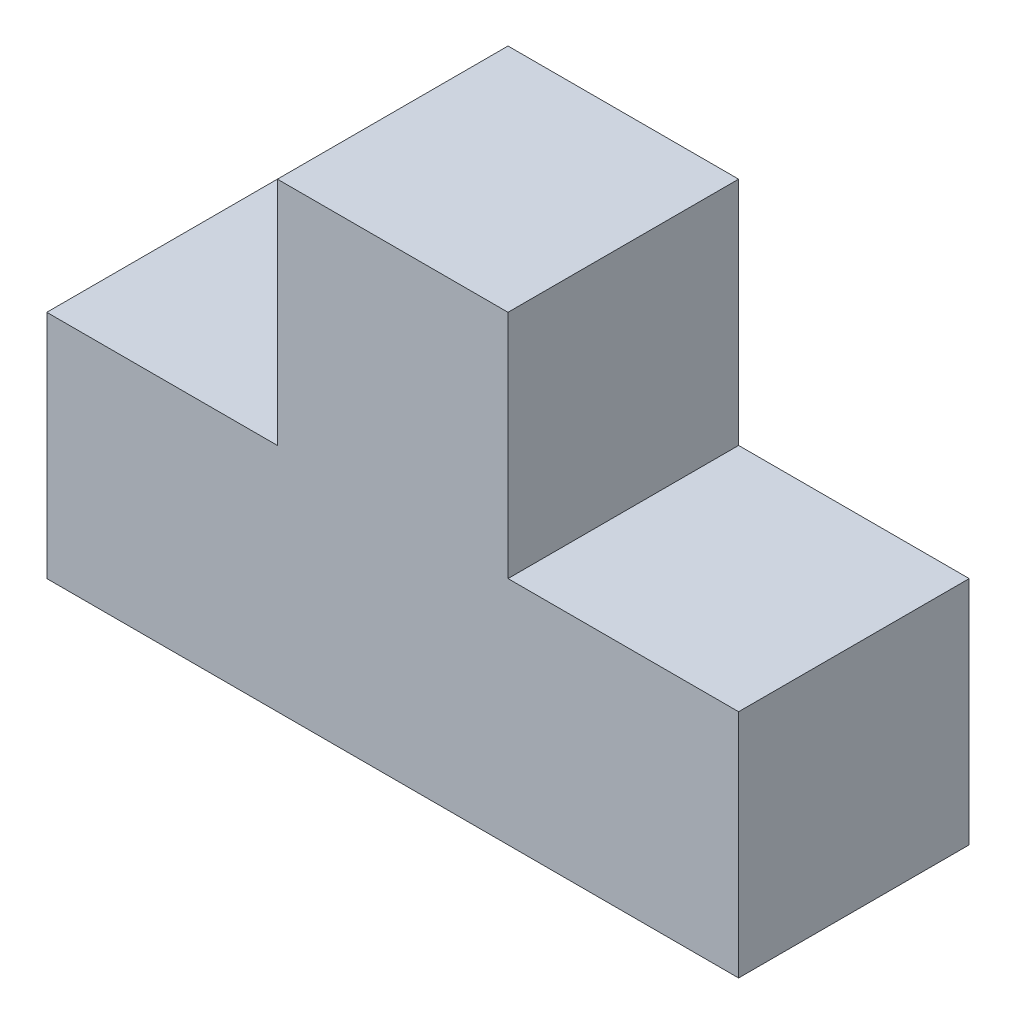
ISO-10303-21;
HEADER;
FILE_DESCRIPTION(('STEP AP214'),'2;1');
FILE_NAME('part.step','',(''),(''),'','','');
FILE_SCHEMA(('AUTOMOTIVE_DESIGN { 1 0 10303 214 1 1 1 1 }'));
ENDSEC;
DATA;
#1=APPLICATION_CONTEXT('core data for automotive mechanical design processes');
#2=APPLICATION_PROTOCOL_DEFINITION('international standard','automotive_design',2000,#1);
#3=PRODUCT_CONTEXT('',#1,'mechanical');
#4=PRODUCT('Part','Part','',(#3));
#5=PRODUCT_RELATED_PRODUCT_CATEGORY('part','',(#4));
#6=PRODUCT_DEFINITION_FORMATION('','',#4);
#7=PRODUCT_DEFINITION_CONTEXT('part definition',#1,'design');
#8=PRODUCT_DEFINITION('design','',#6,#7);
#9=PRODUCT_DEFINITION_SHAPE('','',#8);
#10=(LENGTH_UNIT() NAMED_UNIT(*) SI_UNIT(.MILLI.,.METRE.));
#11=(NAMED_UNIT(*) PLANE_ANGLE_UNIT() SI_UNIT($,.RADIAN.));
#12=(NAMED_UNIT(*) SI_UNIT($,.STERADIAN.) SOLID_ANGLE_UNIT());
#13=UNCERTAINTY_MEASURE_WITH_UNIT(LENGTH_MEASURE(1.E-05),#10,'distance_accuracy_value','');
#14=(GEOMETRIC_REPRESENTATION_CONTEXT(3) GLOBAL_UNCERTAINTY_ASSIGNED_CONTEXT((#13)) GLOBAL_UNIT_ASSIGNED_CONTEXT((#10,
#11,#12)) REPRESENTATION_CONTEXT('',''));
#15=CARTESIAN_POINT('',(0.,0.,0.));
#16=DIRECTION('',(0.,0.,1.));
#17=DIRECTION('',(1.,0.,0.));
#18=AXIS2_PLACEMENT_3D('',#15,#16,#17);
#19=CARTESIAN_POINT('',(0.,30.,30.));
#20=DIRECTION('',(1.,0.,0.));
#21=DIRECTION('',(0.,1.,0.));
#22=AXIS2_PLACEMENT_3D('',#19,#20,#21);
#23=PLANE('',#22);
#24=DIRECTION('',(0.,-1.,0.));
#25=VECTOR('',#24,1.);
#26=CARTESIAN_POINT('',(0.,30.,0.));
#27=LINE('',#26,#25);
#28=CARTESIAN_POINT('',(0.,30.,0.));
#29=VERTEX_POINT('',#28);
#30=CARTESIAN_POINT('',(0.,0.,0.));
#31=VERTEX_POINT('',#30);
#32=EDGE_CURVE('E129',#29,#31,#27,.T.);
#33=ORIENTED_EDGE('',*,*,#32,.T.);
#34=DIRECTION('',(0.,0.,-1.));
#35=VECTOR('',#34,1.);
#36=CARTESIAN_POINT('',(0.,0.,30.));
#37=LINE('',#36,#35);
#38=CARTESIAN_POINT('',(0.,0.,30.));
#39=VERTEX_POINT('',#38);
#40=EDGE_CURVE('E11',#39,#31,#37,.T.);
#41=ORIENTED_EDGE('',*,*,#40,.F.);
#42=DIRECTION('',(0.,-1.,0.));
#43=VECTOR('',#42,1.);
#44=CARTESIAN_POINT('',(0.,30.,30.));
#45=LINE('',#44,#43);
#46=CARTESIAN_POINT('',(0.,30.,30.));
#47=VERTEX_POINT('',#46);
#48=EDGE_CURVE('E143',#47,#39,#45,.T.);
#49=ORIENTED_EDGE('',*,*,#48,.F.);
#50=DIRECTION('',(0.,0.,-1.));
#51=VECTOR('',#50,1.);
#52=CARTESIAN_POINT('',(0.,30.,30.));
#53=LINE('',#52,#51);
#54=EDGE_CURVE('E125',#47,#29,#53,.T.);
#55=ORIENTED_EDGE('',*,*,#54,.T.);
#56=EDGE_LOOP('',(#33,#41,#49,#55));
#57=FACE_BOUND('',#56,.T.);
#58=ADVANCED_FACE('F33',(#57),#23,.F.);
#59=CARTESIAN_POINT('',(0.,0.,30.));
#60=DIRECTION('',(0.,1.,0.));
#61=DIRECTION('',(0.,0.,1.));
#62=AXIS2_PLACEMENT_3D('',#59,#60,#61);
#63=PLANE('',#62);
#64=DIRECTION('',(1.,0.,0.));
#65=VECTOR('',#64,1.);
#66=CARTESIAN_POINT('',(0.,0.,0.));
#67=LINE('',#66,#65);
#68=CARTESIAN_POINT('',(90.,0.,0.));
#69=VERTEX_POINT('',#68);
#70=EDGE_CURVE('E132',#31,#69,#67,.T.);
#71=ORIENTED_EDGE('',*,*,#70,.T.);
#72=DIRECTION('',(0.,0.,-1.));
#73=VECTOR('',#72,1.);
#74=CARTESIAN_POINT('',(90.,0.,30.));
#75=LINE('',#74,#73);
#76=CARTESIAN_POINT('',(90.,0.,30.));
#77=VERTEX_POINT('',#76);
#78=EDGE_CURVE('E41',#77,#69,#75,.T.);
#79=ORIENTED_EDGE('',*,*,#78,.F.);
#80=DIRECTION('',(1.,0.,0.));
#81=VECTOR('',#80,1.);
#82=CARTESIAN_POINT('',(0.,0.,30.));
#83=LINE('',#82,#81);
#84=EDGE_CURVE('E92',#39,#77,#83,.T.);
#85=ORIENTED_EDGE('',*,*,#84,.F.);
#86=ORIENTED_EDGE('',*,*,#40,.T.);
#87=EDGE_LOOP('',(#71,#79,#85,#86));
#88=FACE_BOUND('',#87,.T.);
#89=ADVANCED_FACE('F178',(#88),#63,.F.);
#90=CARTESIAN_POINT('',(90.,0.,30.));
#91=DIRECTION('',(-1.,0.,0.));
#92=DIRECTION('',(0.,0.,1.));
#93=AXIS2_PLACEMENT_3D('',#90,#91,#92);
#94=PLANE('',#93);
#95=DIRECTION('',(0.,1.,0.));
#96=VECTOR('',#95,1.);
#97=CARTESIAN_POINT('',(90.,0.,0.));
#98=LINE('',#97,#96);
#99=CARTESIAN_POINT('',(90.,30.,0.));
#100=VERTEX_POINT('',#99);
#101=EDGE_CURVE('E134',#69,#100,#98,.T.);
#102=ORIENTED_EDGE('',*,*,#101,.T.);
#103=DIRECTION('',(0.,0.,-1.));
#104=VECTOR('',#103,1.);
#105=CARTESIAN_POINT('',(90.,30.,30.));
#106=LINE('',#105,#104);
#107=CARTESIAN_POINT('',(90.,30.,30.));
#108=VERTEX_POINT('',#107);
#109=EDGE_CURVE('E150',#108,#100,#106,.T.);
#110=ORIENTED_EDGE('',*,*,#109,.F.);
#111=DIRECTION('',(0.,1.,0.));
#112=VECTOR('',#111,1.);
#113=CARTESIAN_POINT('',(90.,0.,30.));
#114=LINE('',#113,#112);
#115=EDGE_CURVE('E158',#77,#108,#114,.T.);
#116=ORIENTED_EDGE('',*,*,#115,.F.);
#117=ORIENTED_EDGE('',*,*,#78,.T.);
#118=EDGE_LOOP('',(#102,#110,#116,#117));
#119=FACE_BOUND('',#118,.T.);
#120=ADVANCED_FACE('F156',(#119),#94,.F.);
#121=CARTESIAN_POINT('',(90.,30.,30.));
#122=DIRECTION('',(0.,-1.,0.));
#123=DIRECTION('',(1.,0.,0.));
#124=AXIS2_PLACEMENT_3D('',#121,#122,#123);
#125=PLANE('',#124);
#126=DIRECTION('',(-1.,0.,0.));
#127=VECTOR('',#126,1.);
#128=CARTESIAN_POINT('',(90.,30.,0.));
#129=LINE('',#128,#127);
#130=CARTESIAN_POINT('',(60.,30.,0.));
#131=VERTEX_POINT('',#130);
#132=EDGE_CURVE('E136',#100,#131,#129,.T.);
#133=ORIENTED_EDGE('',*,*,#132,.T.);
#134=DIRECTION('',(0.,0.,-1.));
#135=VECTOR('',#134,1.);
#136=CARTESIAN_POINT('',(60.,30.,30.));
#137=LINE('',#136,#135);
#138=CARTESIAN_POINT('',(60.,30.,30.));
#139=VERTEX_POINT('',#138);
#140=EDGE_CURVE('E147',#139,#131,#137,.T.);
#141=ORIENTED_EDGE('',*,*,#140,.F.);
#142=DIRECTION('',(-1.,0.,0.));
#143=VECTOR('',#142,1.);
#144=CARTESIAN_POINT('',(90.,30.,30.));
#145=LINE('',#144,#143);
#146=EDGE_CURVE('E170',#108,#139,#145,.T.);
#147=ORIENTED_EDGE('',*,*,#146,.F.);
#148=ORIENTED_EDGE('',*,*,#109,.T.);
#149=EDGE_LOOP('',(#133,#141,#147,#148));
#150=FACE_BOUND('',#149,.T.);
#151=ADVANCED_FACE('F166',(#150),#125,.F.);
#152=CARTESIAN_POINT('',(60.,30.,30.));
#153=DIRECTION('',(-1.,0.,0.));
#154=DIRECTION('',(0.,0.,1.));
#155=AXIS2_PLACEMENT_3D('',#152,#153,#154);
#156=PLANE('',#155);
#157=DIRECTION('',(0.,1.,0.));
#158=VECTOR('',#157,1.);
#159=CARTESIAN_POINT('',(60.,30.,0.));
#160=LINE('',#159,#158);
#161=CARTESIAN_POINT('',(60.,60.,0.));
#162=VERTEX_POINT('',#161);
#163=EDGE_CURVE('E138',#131,#162,#160,.T.);
#164=ORIENTED_EDGE('',*,*,#163,.T.);
#165=DIRECTION('',(0.,0.,-1.));
#166=VECTOR('',#165,1.);
#167=CARTESIAN_POINT('',(60.,60.,30.));
#168=LINE('',#167,#166);
#169=CARTESIAN_POINT('',(60.,60.,30.));
#170=VERTEX_POINT('',#169);
#171=EDGE_CURVE('E120',#170,#162,#168,.T.);
#172=ORIENTED_EDGE('',*,*,#171,.F.);
#173=DIRECTION('',(0.,1.,0.));
#174=VECTOR('',#173,1.);
#175=CARTESIAN_POINT('',(60.,30.,30.));
#176=LINE('',#175,#174);
#177=EDGE_CURVE('E111',#139,#170,#176,.T.);
#178=ORIENTED_EDGE('',*,*,#177,.F.);
#179=ORIENTED_EDGE('',*,*,#140,.T.);
#180=EDGE_LOOP('',(#164,#172,#178,#179));
#181=FACE_BOUND('',#180,.T.);
#182=ADVANCED_FACE('F169',(#181),#156,.F.);
#183=CARTESIAN_POINT('',(60.,60.,30.));
#184=DIRECTION('',(0.,-1.,0.));
#185=DIRECTION('',(1.,0.,0.));
#186=AXIS2_PLACEMENT_3D('',#183,#184,#185);
#187=PLANE('',#186);
#188=DIRECTION('',(-1.,0.,0.));
#189=VECTOR('',#188,1.);
#190=CARTESIAN_POINT('',(60.,60.,0.));
#191=LINE('',#190,#189);
#192=CARTESIAN_POINT('',(30.,60.,0.));
#193=VERTEX_POINT('',#192);
#194=EDGE_CURVE('E119',#162,#193,#191,.T.);
#195=ORIENTED_EDGE('',*,*,#194,.T.);
#196=DIRECTION('',(0.,0.,-1.));
#197=VECTOR('',#196,1.);
#198=CARTESIAN_POINT('',(30.,60.,30.));
#199=LINE('',#198,#197);
#200=CARTESIAN_POINT('',(30.,60.,30.));
#201=VERTEX_POINT('',#200);
#202=EDGE_CURVE('E116',#201,#193,#199,.T.);
#203=ORIENTED_EDGE('',*,*,#202,.F.);
#204=DIRECTION('',(-1.,0.,0.));
#205=VECTOR('',#204,1.);
#206=CARTESIAN_POINT('',(60.,60.,30.));
#207=LINE('',#206,#205);
#208=EDGE_CURVE('E105',#170,#201,#207,.T.);
#209=ORIENTED_EDGE('',*,*,#208,.F.);
#210=ORIENTED_EDGE('',*,*,#171,.T.);
#211=EDGE_LOOP('',(#195,#203,#209,#210));
#212=FACE_BOUND('',#211,.T.);
#213=ADVANCED_FACE('F117',(#212),#187,.F.);
#214=CARTESIAN_POINT('',(30.,60.,30.));
#215=DIRECTION('',(1.,0.,0.));
#216=DIRECTION('',(0.,1.,0.));
#217=AXIS2_PLACEMENT_3D('',#214,#215,#216);
#218=PLANE('',#217);
#219=DIRECTION('',(0.,-1.,0.));
#220=VECTOR('',#219,1.);
#221=CARTESIAN_POINT('',(30.,60.,0.));
#222=LINE('',#221,#220);
#223=CARTESIAN_POINT('',(30.,30.,0.));
#224=VERTEX_POINT('',#223);
#225=EDGE_CURVE('E78',#193,#224,#222,.T.);
#226=ORIENTED_EDGE('',*,*,#225,.T.);
#227=DIRECTION('',(0.,0.,-1.));
#228=VECTOR('',#227,1.);
#229=CARTESIAN_POINT('',(30.,30.,30.));
#230=LINE('',#229,#228);
#231=CARTESIAN_POINT('',(30.,30.,30.));
#232=VERTEX_POINT('',#231);
#233=EDGE_CURVE('E121',#232,#224,#230,.T.);
#234=ORIENTED_EDGE('',*,*,#233,.F.);
#235=DIRECTION('',(0.,-1.,0.));
#236=VECTOR('',#235,1.);
#237=CARTESIAN_POINT('',(30.,60.,30.));
#238=LINE('',#237,#236);
#239=EDGE_CURVE('E109',#201,#232,#238,.T.);
#240=ORIENTED_EDGE('',*,*,#239,.F.);
#241=ORIENTED_EDGE('',*,*,#202,.T.);
#242=EDGE_LOOP('',(#226,#234,#240,#241));
#243=FACE_BOUND('',#242,.T.);
#244=ADVANCED_FACE('F123',(#243),#218,.F.);
#245=CARTESIAN_POINT('',(30.,30.,30.));
#246=DIRECTION('',(0.,-1.,0.));
#247=DIRECTION('',(1.,0.,0.));
#248=AXIS2_PLACEMENT_3D('',#245,#246,#247);
#249=PLANE('',#248);
#250=DIRECTION('',(-1.,0.,0.));
#251=VECTOR('',#250,1.);
#252=CARTESIAN_POINT('',(30.,30.,0.));
#253=LINE('',#252,#251);
#254=EDGE_CURVE('E84',#224,#29,#253,.T.);
#255=ORIENTED_EDGE('',*,*,#254,.T.);
#256=ORIENTED_EDGE('',*,*,#54,.F.);
#257=DIRECTION('',(-1.,0.,0.));
#258=VECTOR('',#257,1.);
#259=CARTESIAN_POINT('',(30.,30.,30.));
#260=LINE('',#259,#258);
#261=EDGE_CURVE('E49',#232,#47,#260,.T.);
#262=ORIENTED_EDGE('',*,*,#261,.F.);
#263=ORIENTED_EDGE('',*,*,#233,.T.);
#264=EDGE_LOOP('',(#255,#256,#262,#263));
#265=FACE_BOUND('',#264,.T.);
#266=ADVANCED_FACE('F194',(#265),#249,.F.);
#267=CARTESIAN_POINT('',(0.,0.,30.));
#268=DIRECTION('',(0.,0.,1.));
#269=DIRECTION('',(1.,0.,0.));
#270=AXIS2_PLACEMENT_3D('',#267,#268,#269);
#271=PLANE('',#270);
#272=ORIENTED_EDGE('',*,*,#48,.T.);
#273=ORIENTED_EDGE('',*,*,#84,.T.);
#274=ORIENTED_EDGE('',*,*,#115,.T.);
#275=ORIENTED_EDGE('',*,*,#146,.T.);
#276=ORIENTED_EDGE('',*,*,#177,.T.);
#277=ORIENTED_EDGE('',*,*,#208,.T.);
#278=ORIENTED_EDGE('',*,*,#239,.T.);
#279=ORIENTED_EDGE('',*,*,#261,.T.);
#280=EDGE_LOOP('',(#272,#273,#274,#275,#276,#277,#278,#279));
#281=FACE_BOUND('',#280,.T.);
#282=ADVANCED_FACE('F107',(#281),#271,.T.);
#283=CARTESIAN_POINT('',(0.,0.,0.));
#284=DIRECTION('',(0.,0.,1.));
#285=DIRECTION('',(1.,0.,0.));
#286=AXIS2_PLACEMENT_3D('',#283,#284,#285);
#287=PLANE('',#286);
#288=ORIENTED_EDGE('',*,*,#32,.F.);
#289=ORIENTED_EDGE('',*,*,#254,.F.);
#290=ORIENTED_EDGE('',*,*,#225,.F.);
#291=ORIENTED_EDGE('',*,*,#194,.F.);
#292=ORIENTED_EDGE('',*,*,#163,.F.);
#293=ORIENTED_EDGE('',*,*,#132,.F.);
#294=ORIENTED_EDGE('',*,*,#101,.F.);
#295=ORIENTED_EDGE('',*,*,#70,.F.);
#296=EDGE_LOOP('',(#288,#289,#290,#291,#292,#293,#294,#295));
#297=FACE_BOUND('',#296,.T.);
#298=ADVANCED_FACE('F162',(#297),#287,.F.);
#299=CLOSED_SHELL('',(#58,#89,#120,#151,#182,#213,#244,#266,#282,#298));
#300=MANIFOLD_SOLID_BREP('B2',#299);
#301=ADVANCED_BREP_SHAPE_REPRESENTATION('',(#18,#300),#14);
#302=SHAPE_DEFINITION_REPRESENTATION(#9,#301);
ENDSEC;
END-ISO-10303-21;
